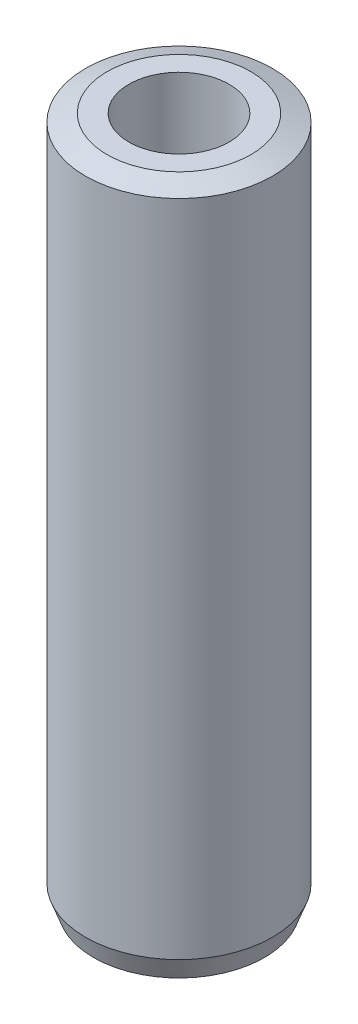
ISO-10303-21;
HEADER;
FILE_DESCRIPTION(('STEP AP214'),'2;1');
FILE_NAME('part.step','',(''),(''),'','','');
FILE_SCHEMA(('AUTOMOTIVE_DESIGN { 1 0 10303 214 1 1 1 1 }'));
ENDSEC;
DATA;
#1=APPLICATION_CONTEXT('core data for automotive mechanical design processes');
#2=APPLICATION_PROTOCOL_DEFINITION('international standard','automotive_design',2000,#1);
#3=PRODUCT_CONTEXT('',#1,'mechanical');
#4=PRODUCT('Part','Part','',(#3));
#5=PRODUCT_RELATED_PRODUCT_CATEGORY('part','',(#4));
#6=PRODUCT_DEFINITION_FORMATION('','',#4);
#7=PRODUCT_DEFINITION_CONTEXT('part definition',#1,'design');
#8=PRODUCT_DEFINITION('design','',#6,#7);
#9=PRODUCT_DEFINITION_SHAPE('','',#8);
#10=(LENGTH_UNIT() NAMED_UNIT(*) SI_UNIT(.MILLI.,.METRE.));
#11=(NAMED_UNIT(*) PLANE_ANGLE_UNIT() SI_UNIT($,.RADIAN.));
#12=(NAMED_UNIT(*) SI_UNIT($,.STERADIAN.) SOLID_ANGLE_UNIT());
#13=UNCERTAINTY_MEASURE_WITH_UNIT(LENGTH_MEASURE(1.E-05),#10,'distance_accuracy_value','');
#14=(GEOMETRIC_REPRESENTATION_CONTEXT(3) GLOBAL_UNCERTAINTY_ASSIGNED_CONTEXT((#13)) GLOBAL_UNIT_ASSIGNED_CONTEXT((#10,
#11,#12)) REPRESENTATION_CONTEXT('',''));
#15=CARTESIAN_POINT('',(0.,0.,0.));
#16=DIRECTION('',(0.,0.,1.));
#17=DIRECTION('',(1.,0.,0.));
#18=AXIS2_PLACEMENT_3D('',#15,#16,#17);
#19=CARTESIAN_POINT('',(0.,184.246852803834,0.));
#20=DIRECTION('',(0.,-1.,0.));
#21=DIRECTION('',(0.,0.,-1.));
#22=AXIS2_PLACEMENT_3D('',#19,#20,#21);
#23=CYLINDRICAL_SURFACE('',#22,25.);
#24=CARTESIAN_POINT('',(0.,182.131825203478,0.));
#25=DIRECTION('',(0.,1.,0.));
#26=DIRECTION('',(0.,0.,1.));
#27=AXIS2_PLACEMENT_3D('',#24,#25,#26);
#28=CIRCLE('',#27,25.);
#29=CARTESIAN_POINT('',(0.,182.131825203478,-25.));
#30=VERTEX_POINT('',#29);
#31=EDGE_CURVE('E50',#30,#30,#28,.F.);
#32=ORIENTED_EDGE('',*,*,#31,.T.);
#33=EDGE_LOOP('',(#32));
#34=FACE_BOUND('',#33,.T.);
#35=CARTESIAN_POINT('',(0.,5.75136560229228,0.));
#36=DIRECTION('',(0.,1.,0.));
#37=DIRECTION('',(0.,0.,1.));
#38=AXIS2_PLACEMENT_3D('',#35,#36,#37);
#39=CIRCLE('',#38,25.);
#40=CARTESIAN_POINT('',(0.,5.75136560229228,25.));
#41=VERTEX_POINT('',#40);
#42=EDGE_CURVE('E51',#41,#41,#39,.T.);
#43=ORIENTED_EDGE('',*,*,#42,.T.);
#44=EDGE_LOOP('',(#43));
#45=FACE_BOUND('',#44,.T.);
#46=ADVANCED_FACE('F39',(#34,#45),#23,.T.);
#47=CARTESIAN_POINT('',(0.,184.246852803834,0.));
#48=DIRECTION('',(0.,1.,0.));
#49=DIRECTION('',(0.,0.,1.));
#50=AXIS2_PLACEMENT_3D('',#47,#48,#49);
#51=PLANE('',#50);
#52=CARTESIAN_POINT('',(0.,184.246852803834,0.));
#53=DIRECTION('',(0.,1.,0.));
#54=DIRECTION('',(0.,0.,1.));
#55=AXIS2_PLACEMENT_3D('',#52,#53,#54);
#56=CIRCLE('',#55,19.2486343977076);
#57=CARTESIAN_POINT('',(0.,184.246852803834,-19.2486343977076));
#58=VERTEX_POINT('',#57);
#59=EDGE_CURVE('E54',#58,#58,#56,.T.);
#60=ORIENTED_EDGE('',*,*,#59,.T.);
#61=EDGE_LOOP('',(#60));
#62=FACE_BOUND('',#61,.T.);
#63=CARTESIAN_POINT('',(0.,184.246852803834,0.));
#64=DIRECTION('',(0.,1.,0.));
#65=DIRECTION('',(0.,0.,1.));
#66=AXIS2_PLACEMENT_3D('',#63,#64,#65);
#67=CIRCLE('',#66,13.4151185034793);
#68=CARTESIAN_POINT('',(0.,184.246852803834,13.4151185034793));
#69=VERTEX_POINT('',#68);
#70=EDGE_CURVE('E58',#69,#69,#67,.T.);
#71=ORIENTED_EDGE('',*,*,#70,.F.);
#72=EDGE_LOOP('',(#71));
#73=FACE_BOUND('',#72,.T.);
#74=ADVANCED_FACE('F69',(#62,#73),#51,.T.);
#75=CARTESIAN_POINT('',(0.,0.,0.));
#76=DIRECTION('',(0.,1.,0.));
#77=DIRECTION('',(0.,0.,1.));
#78=AXIS2_PLACEMENT_3D('',#75,#76,#77);
#79=PLANE('',#78);
#80=CARTESIAN_POINT('',(0.,0.,0.));
#81=DIRECTION('',(0.,1.,0.));
#82=DIRECTION('',(0.,0.,1.));
#83=AXIS2_PLACEMENT_3D('',#80,#81,#82);
#84=CIRCLE('',#83,22.8849723996442);
#85=CARTESIAN_POINT('',(0.,0.,22.8849723996442));
#86=VERTEX_POINT('',#85);
#87=EDGE_CURVE('E10',#86,#86,#84,.F.);
#88=ORIENTED_EDGE('',*,*,#87,.T.);
#89=EDGE_LOOP('',(#88));
#90=FACE_BOUND('',#89,.T.);
#91=CARTESIAN_POINT('',(0.,0.,0.));
#92=DIRECTION('',(0.,1.,0.));
#93=DIRECTION('',(0.,0.,1.));
#94=AXIS2_PLACEMENT_3D('',#91,#92,#93);
#95=CIRCLE('',#94,13.4151185034793);
#96=CARTESIAN_POINT('',(0.,0.,13.4151185034793));
#97=VERTEX_POINT('',#96);
#98=EDGE_CURVE('E63',#97,#97,#95,.T.);
#99=ORIENTED_EDGE('',*,*,#98,.T.);
#100=EDGE_LOOP('',(#99));
#101=FACE_BOUND('',#100,.T.);
#102=ADVANCED_FACE('F75',(#90,#101),#79,.F.);
#103=CARTESIAN_POINT('',(0.,184.246852803834,0.));
#104=DIRECTION('',(0.,-1.,0.));
#105=DIRECTION('',(0.,0.,-1.));
#106=AXIS2_PLACEMENT_3D('',#103,#104,#105);
#107=CYLINDRICAL_SURFACE('',#106,13.4151185034793);
#108=ORIENTED_EDGE('',*,*,#70,.T.);
#109=EDGE_LOOP('',(#108));
#110=FACE_BOUND('',#109,.T.);
#111=ORIENTED_EDGE('',*,*,#98,.F.);
#112=EDGE_LOOP('',(#111));
#113=FACE_BOUND('',#112,.T.);
#114=ADVANCED_FACE('F70',(#110,#113),#107,.F.);
#115=CARTESIAN_POINT('',(0.,184.246852803834,0.));
#116=DIRECTION('',(0.,-1.,0.));
#117=DIRECTION('',(0.,0.,-1.));
#118=AXIS2_PLACEMENT_3D('',#115,#116,#117);
#119=CONICAL_SURFACE('',#118,19.2486343977076,1.21840260338218);
#120=CARTESIAN_POINT('',(0.,182.131825203478,-25.));
#121=CARTESIAN_POINT('',(0.,182.153856740982,-24.9400899416428));
#122=CARTESIAN_POINT('',(0.,182.175888278485,-24.8801798832856));
#123=CARTESIAN_POINT('',(0.,182.219951353493,-24.7603597665712));
#124=CARTESIAN_POINT('',(0.,182.241982890996,-24.700449708214));
#125=CARTESIAN_POINT('',(0.,182.286045966004,-24.5806295914996));
#126=CARTESIAN_POINT('',(0.,182.308077503508,-24.5207195331423));
#127=CARTESIAN_POINT('',(0.,182.352140578515,-24.4008994164279));
#128=CARTESIAN_POINT('',(0.,182.374172116019,-24.3409893580707));
#129=CARTESIAN_POINT('',(0.,182.418235191026,-24.2211692413563));
#130=CARTESIAN_POINT('',(0.,182.44026672853,-24.1612591829991));
#131=CARTESIAN_POINT('',(0.,182.484329803537,-24.0414390662846));
#132=CARTESIAN_POINT('',(0.,182.506361341041,-23.9815290079274));
#133=CARTESIAN_POINT('',(0.,182.550424416048,-23.861708891213));
#134=CARTESIAN_POINT('',(0.,182.572455953552,-23.8017988328558));
#135=CARTESIAN_POINT('',(0.,182.616519028559,-23.6819787161414));
#136=CARTESIAN_POINT('',(0.,182.638550566063,-23.6220686577842));
#137=CARTESIAN_POINT('',(0.,182.682613641071,-23.5022485410697));
#138=CARTESIAN_POINT('',(0.,182.704645178574,-23.4423384827125));
#139=CARTESIAN_POINT('',(0.,182.748708253582,-23.3225183659981));
#140=CARTESIAN_POINT('',(0.,182.770739791085,-23.2626083076409));
#141=CARTESIAN_POINT('',(0.,182.814802866093,-23.1427881909265));
#142=CARTESIAN_POINT('',(0.,182.836834403596,-23.0828781325692));
#143=CARTESIAN_POINT('',(0.,182.880897478604,-22.9630580158548));
#144=CARTESIAN_POINT('',(0.,182.902929016108,-22.9031479574976));
#145=CARTESIAN_POINT('',(0.,182.946992091115,-22.7833278407832));
#146=CARTESIAN_POINT('',(0.,182.969023628619,-22.723417782426));
#147=CARTESIAN_POINT('',(0.,183.013086703626,-22.6035976657115));
#148=CARTESIAN_POINT('',(0.,183.03511824113,-22.5436876073543));
#149=CARTESIAN_POINT('',(0.,183.079181316137,-22.4238674906399));
#150=CARTESIAN_POINT('',(0.,183.101212853641,-22.3639574322827));
#151=CARTESIAN_POINT('',(0.,183.145275928648,-22.2441373155683));
#152=CARTESIAN_POINT('',(0.,183.167307466152,-22.1842272572111));
#153=CARTESIAN_POINT('',(0.,183.21137054116,-22.0644071404966));
#154=CARTESIAN_POINT('',(0.,183.233402078663,-22.0044970821394));
#155=CARTESIAN_POINT('',(0.,183.277465153671,-21.884676965425));
#156=CARTESIAN_POINT('',(0.,183.299496691174,-21.8247669070678));
#157=CARTESIAN_POINT('',(0.,183.343559766182,-21.7049467903534));
#158=CARTESIAN_POINT('',(0.,183.365591303685,-21.6450367319961));
#159=CARTESIAN_POINT('',(0.,183.409654378693,-21.5252166152817));
#160=CARTESIAN_POINT('',(0.,183.431685916197,-21.4653065569245));
#161=CARTESIAN_POINT('',(0.,183.475748991204,-21.3454864402101));
#162=CARTESIAN_POINT('',(0.,183.497780528708,-21.2855763818529));
#163=CARTESIAN_POINT('',(0.,183.541843603715,-21.1657562651384));
#164=CARTESIAN_POINT('',(0.,183.563875141219,-21.1058462067812));
#165=CARTESIAN_POINT('',(0.,183.607938216226,-20.9860260900668));
#166=CARTESIAN_POINT('',(0.,183.62996975373,-20.9261160317096));
#167=CARTESIAN_POINT('',(0.,183.674032828737,-20.8062959149952));
#168=CARTESIAN_POINT('',(0.,183.696064366241,-20.746385856638));
#169=CARTESIAN_POINT('',(0.,183.740127441249,-20.6265657399235));
#170=CARTESIAN_POINT('',(0.,183.762158978752,-20.5666556815663));
#171=CARTESIAN_POINT('',(0.,183.80622205376,-20.4468355648519));
#172=CARTESIAN_POINT('',(0.,183.828253591263,-20.3869255064947));
#173=CARTESIAN_POINT('',(0.,183.872316666271,-20.2671053897803));
#174=CARTESIAN_POINT('',(0.,183.894348203774,-20.207195331423));
#175=CARTESIAN_POINT('',(0.,183.938411278782,-20.0873752147086));
#176=CARTESIAN_POINT('',(0.,183.960442816286,-20.0274651563514));
#177=CARTESIAN_POINT('',(0.,184.004505891293,-19.907645039637));
#178=CARTESIAN_POINT('',(0.,184.026537428797,-19.8477349812798));
#179=CARTESIAN_POINT('',(0.,184.070600503804,-19.7279148645653));
#180=CARTESIAN_POINT('',(0.,184.092632041308,-19.6680048062081));
#181=CARTESIAN_POINT('',(0.,184.136695116315,-19.5481846894937));
#182=CARTESIAN_POINT('',(0.,184.158726653819,-19.4882746311365));
#183=CARTESIAN_POINT('',(0.,184.202789728826,-19.3684545144221));
#184=CARTESIAN_POINT('',(0.,184.22482126633,-19.3085444560649));
#185=CARTESIAN_POINT('',(0.,184.246852803834,-19.2486343977076));
#186=B_SPLINE_CURVE_WITH_KNOTS('',3,(#120,#121,#122,#123,#124,#125,#126,#127,#128,#129,#130,
#131,#132,#133,#134,#135,#136,#137,#138,#139,#140,#141,#142,#143,#144,#145,#146,#147,#148,#149,
#150,#151,#152,#153,#154,#155,#156,#157,#158,#159,#160,#161,#162,#163,#164,#165,#166,#167,#168,
#169,#170,#171,#172,#173,#174,#175,#176,#177,#178,#179,#180,#181,#182,#183,#184,#185),
.UNSPECIFIED.,.F.,.F.,(4,2,2,2,2,2,2,2,2,2,2,2,2,2,2,2,2,2,2,2,2,2,2,2,2,2,2,2,2,2,2,2,4),(0.,
0.191497868484941,0.382995736969881,0.574493605454822,0.765991473939772,0.957489342424713,
1.14898721090966,1.34048507939459,1.53198294787955,1.72348081636449,1.91497868484943,
2.10647655333437,2.29797442181932,2.48947229030426,2.6809701587892,2.87246802727414,
3.06396589575909,3.25546376424403,3.44696163272897,3.63845950121392,3.82995736969887,
4.02145523818381,4.21295310666875,4.40445097515369,4.59594884363864,4.78744671212358,
4.97894458060852,5.17044244909346,5.36194031757841,5.55343818606335,5.7449360545483,
5.93643392303324,6.12793179151819),.UNSPECIFIED.);
#187=EDGE_CURVE('BSEAM81',#30,#58,#186,.T.);
#188=ORIENTED_EDGE('',*,*,#31,.F.);
#189=ORIENTED_EDGE('',*,*,#59,.F.);
#190=ORIENTED_EDGE('',*,*,#187,.T.);
#191=ORIENTED_EDGE('',*,*,#187,.F.);
#192=EDGE_LOOP('',(#188,#190,#189,#191));
#193=FACE_BOUND('',#192,.T.);
#194=ADVANCED_FACE('F81',(#193),#119,.T.);
#195=CARTESIAN_POINT('',(0.,5.75136560229228,0.));
#196=DIRECTION('',(0.,1.,0.));
#197=DIRECTION('',(0.,0.,1.));
#198=AXIS2_PLACEMENT_3D('',#195,#196,#197);
#199=CONICAL_SURFACE('',#198,25.,0.352393723412719);
#200=ORIENTED_EDGE('',*,*,#87,.F.);
#201=EDGE_LOOP('',(#200));
#202=FACE_BOUND('',#201,.T.);
#203=ORIENTED_EDGE('',*,*,#42,.F.);
#204=EDGE_LOOP('',(#203));
#205=FACE_BOUND('',#204,.T.);
#206=ADVANCED_FACE('F45',(#202,#205),#199,.T.);
#207=CLOSED_SHELL('',(#46,#74,#102,#114,#194,#206));
#208=MANIFOLD_SOLID_BREP('B2',#207);
#209=ADVANCED_BREP_SHAPE_REPRESENTATION('',(#18,#208),#14);
#210=SHAPE_DEFINITION_REPRESENTATION(#9,#209);
ENDSEC;
END-ISO-10303-21;
